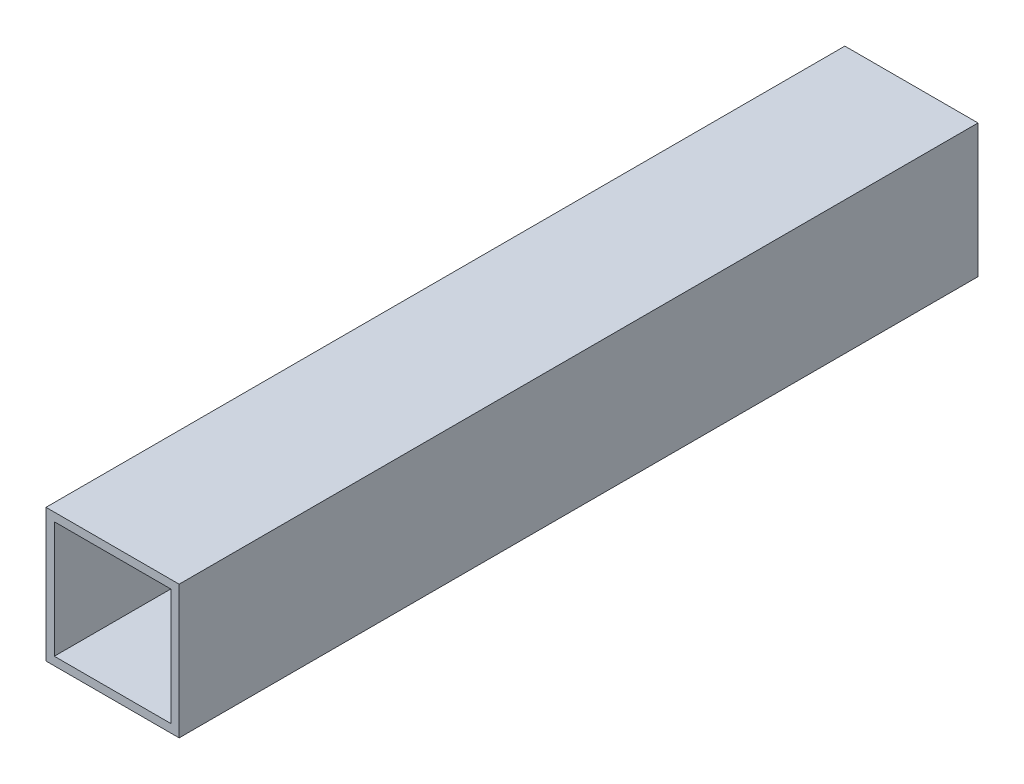
ISO-10303-21;
HEADER;
FILE_DESCRIPTION(('STEP AP214'),'2;1');
FILE_NAME('part.step','',(''),(''),'','','');
FILE_SCHEMA(('AUTOMOTIVE_DESIGN { 1 0 10303 214 1 1 1 1 }'));
ENDSEC;
DATA;
#1=APPLICATION_CONTEXT('core data for automotive mechanical design processes');
#2=APPLICATION_PROTOCOL_DEFINITION('international standard','automotive_design',2000,#1);
#3=PRODUCT_CONTEXT('',#1,'mechanical');
#4=PRODUCT('Part','Part','',(#3));
#5=PRODUCT_RELATED_PRODUCT_CATEGORY('part','',(#4));
#6=PRODUCT_DEFINITION_FORMATION('','',#4);
#7=PRODUCT_DEFINITION_CONTEXT('part definition',#1,'design');
#8=PRODUCT_DEFINITION('design','',#6,#7);
#9=PRODUCT_DEFINITION_SHAPE('','',#8);
#10=(LENGTH_UNIT() NAMED_UNIT(*) SI_UNIT(.MILLI.,.METRE.));
#11=(NAMED_UNIT(*) PLANE_ANGLE_UNIT() SI_UNIT($,.RADIAN.));
#12=(NAMED_UNIT(*) SI_UNIT($,.STERADIAN.) SOLID_ANGLE_UNIT());
#13=UNCERTAINTY_MEASURE_WITH_UNIT(LENGTH_MEASURE(1.E-05),#10,'distance_accuracy_value','');
#14=(GEOMETRIC_REPRESENTATION_CONTEXT(3) GLOBAL_UNCERTAINTY_ASSIGNED_CONTEXT((#13)) GLOBAL_UNIT_ASSIGNED_CONTEXT((#10,
#11,#12)) REPRESENTATION_CONTEXT('',''));
#15=CARTESIAN_POINT('',(0.,0.,0.));
#16=DIRECTION('',(0.,0.,1.));
#17=DIRECTION('',(1.,0.,0.));
#18=AXIS2_PLACEMENT_3D('',#15,#16,#17);
#19=CARTESIAN_POINT('',(0.,0.,76.2));
#20=DIRECTION('',(0.,0.,1.));
#21=DIRECTION('',(1.,0.,0.));
#22=AXIS2_PLACEMENT_3D('',#19,#20,#21);
#23=PLANE('',#22);
#24=DIRECTION('',(0.,-1.,0.));
#25=VECTOR('',#24,1.);
#26=CARTESIAN_POINT('',(-12.7,12.7,76.2));
#27=LINE('',#26,#25);
#28=CARTESIAN_POINT('',(-12.7,12.7,76.2));
#29=VERTEX_POINT('',#28);
#30=CARTESIAN_POINT('',(-12.7,-12.7,76.2));
#31=VERTEX_POINT('',#30);
#32=EDGE_CURVE('E119',#29,#31,#27,.T.);
#33=ORIENTED_EDGE('',*,*,#32,.T.);
#34=DIRECTION('',(1.,0.,0.));
#35=VECTOR('',#34,1.);
#36=CARTESIAN_POINT('',(-12.7,-12.7,76.2));
#37=LINE('',#36,#35);
#38=CARTESIAN_POINT('',(12.7,-12.7,76.2));
#39=VERTEX_POINT('',#38);
#40=EDGE_CURVE('E178',#31,#39,#37,.T.);
#41=ORIENTED_EDGE('',*,*,#40,.T.);
#42=DIRECTION('',(0.,1.,0.));
#43=VECTOR('',#42,1.);
#44=CARTESIAN_POINT('',(12.7,-12.7,76.2));
#45=LINE('',#44,#43);
#46=CARTESIAN_POINT('',(12.7,12.7,76.2));
#47=VERTEX_POINT('',#46);
#48=EDGE_CURVE('E181',#39,#47,#45,.T.);
#49=ORIENTED_EDGE('',*,*,#48,.T.);
#50=DIRECTION('',(-1.,0.,0.));
#51=VECTOR('',#50,1.);
#52=CARTESIAN_POINT('',(12.7,12.7,76.2));
#53=LINE('',#52,#51);
#54=EDGE_CURVE('E65',#47,#29,#53,.T.);
#55=ORIENTED_EDGE('',*,*,#54,.T.);
#56=EDGE_LOOP('',(#33,#41,#49,#55));
#57=FACE_BOUND('',#56,.T.);
#58=DIRECTION('',(1.,0.,0.));
#59=VECTOR('',#58,1.);
#60=CARTESIAN_POINT('',(-11.1125,-11.1125,76.2));
#61=LINE('',#60,#59);
#62=CARTESIAN_POINT('',(-11.1125,-11.1125,76.2));
#63=VERTEX_POINT('',#62);
#64=CARTESIAN_POINT('',(11.1125,-11.1125,76.2));
#65=VERTEX_POINT('',#64);
#66=EDGE_CURVE('E160',#63,#65,#61,.T.);
#67=ORIENTED_EDGE('',*,*,#66,.F.);
#68=DIRECTION('',(0.,-1.,0.));
#69=VECTOR('',#68,1.);
#70=CARTESIAN_POINT('',(-11.1125,11.1125,76.2));
#71=LINE('',#70,#69);
#72=CARTESIAN_POINT('',(-11.1125,11.1125,76.2));
#73=VERTEX_POINT('',#72);
#74=EDGE_CURVE('E115',#73,#63,#71,.T.);
#75=ORIENTED_EDGE('',*,*,#74,.F.);
#76=DIRECTION('',(-1.,0.,0.));
#77=VECTOR('',#76,1.);
#78=CARTESIAN_POINT('',(11.1125,11.1125,76.2));
#79=LINE('',#78,#77);
#80=CARTESIAN_POINT('',(11.1125,11.1125,76.2));
#81=VERTEX_POINT('',#80);
#82=EDGE_CURVE('E166',#81,#73,#79,.T.);
#83=ORIENTED_EDGE('',*,*,#82,.F.);
#84=DIRECTION('',(0.,1.,0.));
#85=VECTOR('',#84,1.);
#86=CARTESIAN_POINT('',(11.1125,-11.1125,76.2));
#87=LINE('',#86,#85);
#88=EDGE_CURVE('E163',#65,#81,#87,.T.);
#89=ORIENTED_EDGE('',*,*,#88,.F.);
#90=EDGE_LOOP('',(#67,#75,#83,#89));
#91=FACE_BOUND('',#90,.T.);
#92=ADVANCED_FACE('F41',(#57,#91),#23,.T.);
#93=CARTESIAN_POINT('',(-12.7,12.7,76.2));
#94=DIRECTION('',(1.,0.,0.));
#95=DIRECTION('',(0.,0.,-1.));
#96=AXIS2_PLACEMENT_3D('',#93,#94,#95);
#97=PLANE('',#96);
#98=DIRECTION('',(0.,0.,-1.));
#99=VECTOR('',#98,1.);
#100=CARTESIAN_POINT('',(-12.7,12.7,76.2));
#101=LINE('',#100,#99);
#102=CARTESIAN_POINT('',(-12.7,12.7,-76.2));
#103=VERTEX_POINT('',#102);
#104=EDGE_CURVE('E186',#29,#103,#101,.T.);
#105=ORIENTED_EDGE('',*,*,#104,.T.);
#106=DIRECTION('',(0.,-1.,0.));
#107=VECTOR('',#106,1.);
#108=CARTESIAN_POINT('',(-12.7,12.7,-76.2));
#109=LINE('',#108,#107);
#110=CARTESIAN_POINT('',(-12.7,-12.7,-76.2));
#111=VERTEX_POINT('',#110);
#112=EDGE_CURVE('E142',#103,#111,#109,.T.);
#113=ORIENTED_EDGE('',*,*,#112,.T.);
#114=DIRECTION('',(0.,0.,-1.));
#115=VECTOR('',#114,1.);
#116=CARTESIAN_POINT('',(-12.7,-12.7,76.2));
#117=LINE('',#116,#115);
#118=EDGE_CURVE('E11',#31,#111,#117,.T.);
#119=ORIENTED_EDGE('',*,*,#118,.F.);
#120=ORIENTED_EDGE('',*,*,#32,.F.);
#121=EDGE_LOOP('',(#105,#113,#119,#120));
#122=FACE_BOUND('',#121,.T.);
#123=ADVANCED_FACE('F43',(#122),#97,.F.);
#124=CARTESIAN_POINT('',(-12.7,-12.7,76.2));
#125=DIRECTION('',(0.,1.,0.));
#126=DIRECTION('',(-1.,0.,0.));
#127=AXIS2_PLACEMENT_3D('',#124,#125,#126);
#128=PLANE('',#127);
#129=ORIENTED_EDGE('',*,*,#118,.T.);
#130=DIRECTION('',(1.,0.,0.));
#131=VECTOR('',#130,1.);
#132=CARTESIAN_POINT('',(-12.7,-12.7,-76.2));
#133=LINE('',#132,#131);
#134=CARTESIAN_POINT('',(12.7,-12.7,-76.2));
#135=VERTEX_POINT('',#134);
#136=EDGE_CURVE('E146',#111,#135,#133,.T.);
#137=ORIENTED_EDGE('',*,*,#136,.T.);
#138=DIRECTION('',(0.,0.,-1.));
#139=VECTOR('',#138,1.);
#140=CARTESIAN_POINT('',(12.7,-12.7,76.2));
#141=LINE('',#140,#139);
#142=EDGE_CURVE('E50',#39,#135,#141,.T.);
#143=ORIENTED_EDGE('',*,*,#142,.F.);
#144=ORIENTED_EDGE('',*,*,#40,.F.);
#145=EDGE_LOOP('',(#129,#137,#143,#144));
#146=FACE_BOUND('',#145,.T.);
#147=ADVANCED_FACE('F202',(#146),#128,.F.);
#148=CARTESIAN_POINT('',(12.7,-12.7,76.2));
#149=DIRECTION('',(-1.,0.,0.));
#150=DIRECTION('',(0.,0.,1.));
#151=AXIS2_PLACEMENT_3D('',#148,#149,#150);
#152=PLANE('',#151);
#153=ORIENTED_EDGE('',*,*,#142,.T.);
#154=DIRECTION('',(0.,1.,0.));
#155=VECTOR('',#154,1.);
#156=CARTESIAN_POINT('',(12.7,-12.7,-76.2));
#157=LINE('',#156,#155);
#158=CARTESIAN_POINT('',(12.7,12.7,-76.2));
#159=VERTEX_POINT('',#158);
#160=EDGE_CURVE('E150',#135,#159,#157,.T.);
#161=ORIENTED_EDGE('',*,*,#160,.T.);
#162=DIRECTION('',(0.,0.,-1.));
#163=VECTOR('',#162,1.);
#164=CARTESIAN_POINT('',(12.7,12.7,76.2));
#165=LINE('',#164,#163);
#166=EDGE_CURVE('E189',#47,#159,#165,.T.);
#167=ORIENTED_EDGE('',*,*,#166,.F.);
#168=ORIENTED_EDGE('',*,*,#48,.F.);
#169=EDGE_LOOP('',(#153,#161,#167,#168));
#170=FACE_BOUND('',#169,.T.);
#171=ADVANCED_FACE('F196',(#170),#152,.F.);
#172=CARTESIAN_POINT('',(12.7,12.7,76.2));
#173=DIRECTION('',(0.,-1.,0.));
#174=DIRECTION('',(1.,0.,0.));
#175=AXIS2_PLACEMENT_3D('',#172,#173,#174);
#176=PLANE('',#175);
#177=ORIENTED_EDGE('',*,*,#166,.T.);
#178=DIRECTION('',(-1.,0.,0.));
#179=VECTOR('',#178,1.);
#180=CARTESIAN_POINT('',(12.7,12.7,-76.2));
#181=LINE('',#180,#179);
#182=EDGE_CURVE('E154',#159,#103,#181,.T.);
#183=ORIENTED_EDGE('',*,*,#182,.T.);
#184=ORIENTED_EDGE('',*,*,#104,.F.);
#185=ORIENTED_EDGE('',*,*,#54,.F.);
#186=EDGE_LOOP('',(#177,#183,#184,#185));
#187=FACE_BOUND('',#186,.T.);
#188=ADVANCED_FACE('F207',(#187),#176,.F.);
#189=CARTESIAN_POINT('',(-11.1125,11.1125,76.2));
#190=DIRECTION('',(1.,0.,0.));
#191=DIRECTION('',(0.,1.,0.));
#192=AXIS2_PLACEMENT_3D('',#189,#190,#191);
#193=PLANE('',#192);
#194=DIRECTION('',(0.,0.,-1.));
#195=VECTOR('',#194,1.);
#196=CARTESIAN_POINT('',(-11.1125,-11.1125,76.2));
#197=LINE('',#196,#195);
#198=CARTESIAN_POINT('',(-11.1125,-11.1125,-76.2));
#199=VERTEX_POINT('',#198);
#200=EDGE_CURVE('E107',#63,#199,#197,.T.);
#201=ORIENTED_EDGE('',*,*,#200,.T.);
#202=DIRECTION('',(0.,-1.,0.));
#203=VECTOR('',#202,1.);
#204=CARTESIAN_POINT('',(-11.1125,11.1125,-76.2));
#205=LINE('',#204,#203);
#206=CARTESIAN_POINT('',(-11.1125,11.1125,-76.2));
#207=VERTEX_POINT('',#206);
#208=EDGE_CURVE('E112',#207,#199,#205,.T.);
#209=ORIENTED_EDGE('',*,*,#208,.F.);
#210=DIRECTION('',(0.,0.,-1.));
#211=VECTOR('',#210,1.);
#212=CARTESIAN_POINT('',(-11.1125,11.1125,76.2));
#213=LINE('',#212,#211);
#214=EDGE_CURVE('E169',#73,#207,#213,.T.);
#215=ORIENTED_EDGE('',*,*,#214,.F.);
#216=ORIENTED_EDGE('',*,*,#74,.T.);
#217=EDGE_LOOP('',(#201,#209,#215,#216));
#218=FACE_BOUND('',#217,.T.);
#219=ADVANCED_FACE('F109',(#218),#193,.T.);
#220=CARTESIAN_POINT('',(-11.1125,-11.1125,76.2));
#221=DIRECTION('',(0.,1.,0.));
#222=DIRECTION('',(0.,0.,1.));
#223=AXIS2_PLACEMENT_3D('',#220,#221,#222);
#224=PLANE('',#223);
#225=DIRECTION('',(0.,0.,-1.));
#226=VECTOR('',#225,1.);
#227=CARTESIAN_POINT('',(11.1125,-11.1125,76.2));
#228=LINE('',#227,#226);
#229=CARTESIAN_POINT('',(11.1125,-11.1125,-76.2));
#230=VERTEX_POINT('',#229);
#231=EDGE_CURVE('E120',#65,#230,#228,.T.);
#232=ORIENTED_EDGE('',*,*,#231,.T.);
#233=DIRECTION('',(1.,0.,0.));
#234=VECTOR('',#233,1.);
#235=CARTESIAN_POINT('',(-11.1125,-11.1125,-76.2));
#236=LINE('',#235,#234);
#237=EDGE_CURVE('E123',#199,#230,#236,.T.);
#238=ORIENTED_EDGE('',*,*,#237,.F.);
#239=ORIENTED_EDGE('',*,*,#200,.F.);
#240=ORIENTED_EDGE('',*,*,#66,.T.);
#241=EDGE_LOOP('',(#232,#238,#239,#240));
#242=FACE_BOUND('',#241,.T.);
#243=ADVANCED_FACE('F124',(#242),#224,.T.);
#244=CARTESIAN_POINT('',(11.1125,-11.1125,76.2));
#245=DIRECTION('',(-1.,0.,0.));
#246=DIRECTION('',(0.,-1.,0.));
#247=AXIS2_PLACEMENT_3D('',#244,#245,#246);
#248=PLANE('',#247);
#249=DIRECTION('',(0.,0.,-1.));
#250=VECTOR('',#249,1.);
#251=CARTESIAN_POINT('',(11.1125,11.1125,76.2));
#252=LINE('',#251,#250);
#253=CARTESIAN_POINT('',(11.1125,11.1125,-76.2));
#254=VERTEX_POINT('',#253);
#255=EDGE_CURVE('E57',#81,#254,#252,.T.);
#256=ORIENTED_EDGE('',*,*,#255,.T.);
#257=DIRECTION('',(0.,1.,0.));
#258=VECTOR('',#257,1.);
#259=CARTESIAN_POINT('',(11.1125,-11.1125,-76.2));
#260=LINE('',#259,#258);
#261=EDGE_CURVE('E130',#230,#254,#260,.T.);
#262=ORIENTED_EDGE('',*,*,#261,.F.);
#263=ORIENTED_EDGE('',*,*,#231,.F.);
#264=ORIENTED_EDGE('',*,*,#88,.T.);
#265=EDGE_LOOP('',(#256,#262,#263,#264));
#266=FACE_BOUND('',#265,.T.);
#267=ADVANCED_FACE('F225',(#266),#248,.T.);
#268=CARTESIAN_POINT('',(11.1125,11.1125,76.2));
#269=DIRECTION('',(0.,-1.,0.));
#270=DIRECTION('',(0.,0.,-1.));
#271=AXIS2_PLACEMENT_3D('',#268,#269,#270);
#272=PLANE('',#271);
#273=ORIENTED_EDGE('',*,*,#214,.T.);
#274=DIRECTION('',(-1.,0.,0.));
#275=VECTOR('',#274,1.);
#276=CARTESIAN_POINT('',(11.1125,11.1125,-76.2));
#277=LINE('',#276,#275);
#278=EDGE_CURVE('E134',#254,#207,#277,.T.);
#279=ORIENTED_EDGE('',*,*,#278,.F.);
#280=ORIENTED_EDGE('',*,*,#255,.F.);
#281=ORIENTED_EDGE('',*,*,#82,.T.);
#282=EDGE_LOOP('',(#273,#279,#280,#281));
#283=FACE_BOUND('',#282,.T.);
#284=ADVANCED_FACE('F228',(#283),#272,.T.);
#285=CARTESIAN_POINT('',(0.,0.,-76.2));
#286=DIRECTION('',(0.,0.,1.));
#287=DIRECTION('',(1.,0.,0.));
#288=AXIS2_PLACEMENT_3D('',#285,#286,#287);
#289=PLANE('',#288);
#290=ORIENTED_EDGE('',*,*,#278,.T.);
#291=ORIENTED_EDGE('',*,*,#208,.T.);
#292=ORIENTED_EDGE('',*,*,#237,.T.);
#293=ORIENTED_EDGE('',*,*,#261,.T.);
#294=EDGE_LOOP('',(#290,#291,#292,#293));
#295=FACE_BOUND('',#294,.T.);
#296=ORIENTED_EDGE('',*,*,#112,.F.);
#297=ORIENTED_EDGE('',*,*,#182,.F.);
#298=ORIENTED_EDGE('',*,*,#160,.F.);
#299=ORIENTED_EDGE('',*,*,#136,.F.);
#300=EDGE_LOOP('',(#296,#297,#298,#299));
#301=FACE_BOUND('',#300,.T.);
#302=ADVANCED_FACE('F132',(#295,#301),#289,.F.);
#303=CLOSED_SHELL('',(#92,#123,#147,#171,#188,#219,#243,#267,#284,#302));
#304=MANIFOLD_SOLID_BREP('B2',#303);
#305=ADVANCED_BREP_SHAPE_REPRESENTATION('',(#18,#304),#14);
#306=SHAPE_DEFINITION_REPRESENTATION(#9,#305);
ENDSEC;
END-ISO-10303-21;
